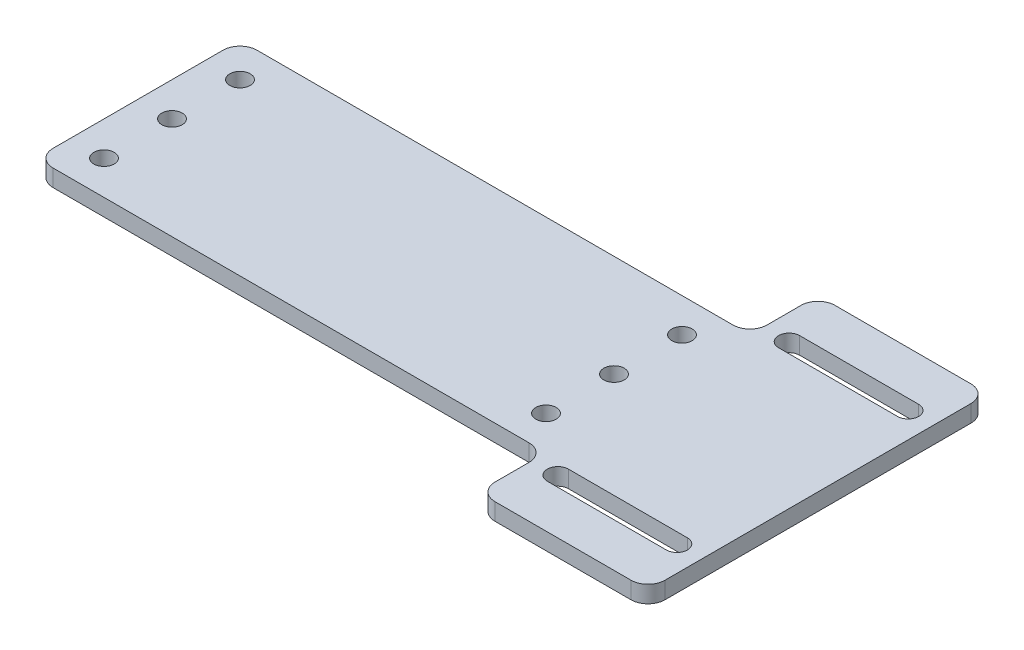
ISO-10303-21;
HEADER;
FILE_DESCRIPTION(('STEP AP214'),'2;1');
FILE_NAME('part.step','',(''),(''),'','','');
FILE_SCHEMA(('AUTOMOTIVE_DESIGN { 1 0 10303 214 1 1 1 1 }'));
ENDSEC;
DATA;
#1=APPLICATION_CONTEXT('core data for automotive mechanical design processes');
#2=APPLICATION_PROTOCOL_DEFINITION('international standard','automotive_design',2000,#1);
#3=PRODUCT_CONTEXT('',#1,'mechanical');
#4=PRODUCT('Part','Part','',(#3));
#5=PRODUCT_RELATED_PRODUCT_CATEGORY('part','',(#4));
#6=PRODUCT_DEFINITION_FORMATION('','',#4);
#7=PRODUCT_DEFINITION_CONTEXT('part definition',#1,'design');
#8=PRODUCT_DEFINITION('design','',#6,#7);
#9=PRODUCT_DEFINITION_SHAPE('','',#8);
#10=(LENGTH_UNIT() NAMED_UNIT(*) SI_UNIT(.MILLI.,.METRE.));
#11=(NAMED_UNIT(*) PLANE_ANGLE_UNIT() SI_UNIT($,.RADIAN.));
#12=(NAMED_UNIT(*) SI_UNIT($,.STERADIAN.) SOLID_ANGLE_UNIT());
#13=UNCERTAINTY_MEASURE_WITH_UNIT(LENGTH_MEASURE(1.E-05),#10,'distance_accuracy_value','');
#14=(GEOMETRIC_REPRESENTATION_CONTEXT(3) GLOBAL_UNCERTAINTY_ASSIGNED_CONTEXT((#13)) GLOBAL_UNIT_ASSIGNED_CONTEXT((#10,
#11,#12)) REPRESENTATION_CONTEXT('',''));
#15=CARTESIAN_POINT('',(0.,0.,0.));
#16=DIRECTION('',(0.,0.,1.));
#17=DIRECTION('',(1.,0.,0.));
#18=AXIS2_PLACEMENT_3D('',#15,#16,#17);
#19=CARTESIAN_POINT('',(0.,5.,0.));
#20=DIRECTION('',(0.,-1.,0.));
#21=DIRECTION('',(0.,0.,-1.));
#22=AXIS2_PLACEMENT_3D('',#19,#20,#21);
#23=PLANE('',#22);
#24=CARTESIAN_POINT('',(-90.,5.,19.9999999999999));
#25=DIRECTION('',(0.,1.,0.));
#26=DIRECTION('',(0.,0.,1.));
#27=AXIS2_PLACEMENT_3D('',#24,#25,#26);
#28=CIRCLE('',#27,3.00000000000001);
#29=CARTESIAN_POINT('',(-90.,5.,22.9999999999999));
#30=VERTEX_POINT('',#29);
#31=EDGE_CURVE('E298',#30,#30,#28,.T.);
#32=ORIENTED_EDGE('',*,*,#31,.F.);
#33=EDGE_LOOP('',(#32));
#34=FACE_BOUND('',#33,.T.);
#35=CARTESIAN_POINT('',(40.,5.,20.));
#36=DIRECTION('',(0.,1.,0.));
#37=DIRECTION('',(0.,0.,1.));
#38=AXIS2_PLACEMENT_3D('',#35,#36,#37);
#39=CIRCLE('',#38,3.);
#40=CARTESIAN_POINT('',(40.,5.,23.));
#41=VERTEX_POINT('',#40);
#42=EDGE_CURVE('E304',#41,#41,#39,.T.);
#43=ORIENTED_EDGE('',*,*,#42,.F.);
#44=EDGE_LOOP('',(#43));
#45=FACE_BOUND('',#44,.T.);
#46=CARTESIAN_POINT('',(40.,5.,-20.));
#47=DIRECTION('',(0.,1.,0.));
#48=DIRECTION('',(0.,0.,1.));
#49=AXIS2_PLACEMENT_3D('',#46,#47,#48);
#50=CIRCLE('',#49,3.);
#51=CARTESIAN_POINT('',(40.,5.,-17.));
#52=VERTEX_POINT('',#51);
#53=EDGE_CURVE('E310',#52,#52,#50,.T.);
#54=ORIENTED_EDGE('',*,*,#53,.F.);
#55=EDGE_LOOP('',(#54));
#56=FACE_BOUND('',#55,.T.);
#57=CARTESIAN_POINT('',(-90.,5.,0.));
#58=DIRECTION('',(0.,1.,0.));
#59=DIRECTION('',(0.,0.,1.));
#60=AXIS2_PLACEMENT_3D('',#57,#58,#59);
#61=CIRCLE('',#60,3.00000000000001);
#62=CARTESIAN_POINT('',(-90.,5.,3.00000000000002));
#63=VERTEX_POINT('',#62);
#64=EDGE_CURVE('E291',#63,#63,#61,.T.);
#65=ORIENTED_EDGE('',*,*,#64,.F.);
#66=EDGE_LOOP('',(#65));
#67=FACE_BOUND('',#66,.T.);
#68=CARTESIAN_POINT('',(40.,5.,0.));
#69=DIRECTION('',(0.,1.,0.));
#70=DIRECTION('',(0.,0.,1.));
#71=AXIS2_PLACEMENT_3D('',#68,#69,#70);
#72=CIRCLE('',#71,3.);
#73=CARTESIAN_POINT('',(40.,5.,3.));
#74=VERTEX_POINT('',#73);
#75=EDGE_CURVE('E277',#74,#74,#72,.T.);
#76=ORIENTED_EDGE('',*,*,#75,.F.);
#77=EDGE_LOOP('',(#76));
#78=FACE_BOUND('',#77,.T.);
#79=CARTESIAN_POINT('',(-90.,5.,-20.0000000000001));
#80=DIRECTION('',(0.,1.,0.));
#81=DIRECTION('',(0.,0.,1.));
#82=AXIS2_PLACEMENT_3D('',#79,#80,#81);
#83=CIRCLE('',#82,3.00000000000001);
#84=CARTESIAN_POINT('',(-90.,5.,-17.0000000000001));
#85=VERTEX_POINT('',#84);
#86=EDGE_CURVE('E297',#85,#85,#83,.T.);
#87=ORIENTED_EDGE('',*,*,#86,.F.);
#88=EDGE_LOOP('',(#87));
#89=FACE_BOUND('',#88,.T.);
#90=DIRECTION('',(0.,0.,-1.));
#91=VECTOR('',#90,1.);
#92=CARTESIAN_POINT('',(100.,5.,30.));
#93=LINE('',#92,#91);
#94=CARTESIAN_POINT('',(100.,5.,45.));
#95=VERTEX_POINT('',#94);
#96=CARTESIAN_POINT('',(100.,5.,-45.));
#97=VERTEX_POINT('',#96);
#98=EDGE_CURVE('E324',#95,#97,#93,.T.);
#99=ORIENTED_EDGE('',*,*,#98,.T.);
#100=CARTESIAN_POINT('',(95.,5.,-45.));
#101=DIRECTION('',(0.,-1.,0.));
#102=DIRECTION('',(0.,0.,-1.));
#103=AXIS2_PLACEMENT_3D('',#100,#101,#102);
#104=CIRCLE('',#103,5.);
#105=CARTESIAN_POINT('',(95.,5.,-50.));
#106=VERTEX_POINT('',#105);
#107=EDGE_CURVE('E378',#97,#106,#104,.F.);
#108=ORIENTED_EDGE('',*,*,#107,.T.);
#109=DIRECTION('',(1.,0.,0.));
#110=VECTOR('',#109,1.);
#111=CARTESIAN_POINT('',(50.,5.,-50.));
#112=LINE('',#111,#110);
#113=CARTESIAN_POINT('',(55.,5.,-50.));
#114=VERTEX_POINT('',#113);
#115=EDGE_CURVE('E273',#114,#106,#112,.T.);
#116=ORIENTED_EDGE('',*,*,#115,.F.);
#117=CARTESIAN_POINT('',(55.,5.,-45.));
#118=DIRECTION('',(0.,-1.,0.));
#119=DIRECTION('',(0.,0.,-1.));
#120=AXIS2_PLACEMENT_3D('',#117,#118,#119);
#121=CIRCLE('',#120,5.);
#122=CARTESIAN_POINT('',(50.,5.,-45.));
#123=VERTEX_POINT('',#122);
#124=EDGE_CURVE('E376',#114,#123,#121,.F.);
#125=ORIENTED_EDGE('',*,*,#124,.T.);
#126=DIRECTION('',(0.,0.,-1.));
#127=VECTOR('',#126,1.);
#128=CARTESIAN_POINT('',(50.,5.,50.));
#129=LINE('',#128,#127);
#130=CARTESIAN_POINT('',(50.,5.,-35.));
#131=VERTEX_POINT('',#130);
#132=EDGE_CURVE('E272',#131,#123,#129,.T.);
#133=ORIENTED_EDGE('',*,*,#132,.F.);
#134=CARTESIAN_POINT('',(45.,5.,-35.));
#135=DIRECTION('',(0.,-1.,0.));
#136=DIRECTION('',(0.,0.,-1.));
#137=AXIS2_PLACEMENT_3D('',#134,#135,#136);
#138=CIRCLE('',#137,5.);
#139=CARTESIAN_POINT('',(45.,5.,-30.));
#140=VERTEX_POINT('',#139);
#141=EDGE_CURVE('E409',#131,#140,#138,.T.);
#142=ORIENTED_EDGE('',*,*,#141,.T.);
#143=DIRECTION('',(-1.,0.,0.));
#144=VECTOR('',#143,1.);
#145=CARTESIAN_POINT('',(-100.,5.,-30.));
#146=LINE('',#145,#144);
#147=CARTESIAN_POINT('',(-95.,5.,-30.));
#148=VERTEX_POINT('',#147);
#149=EDGE_CURVE('E327',#140,#148,#146,.T.);
#150=ORIENTED_EDGE('',*,*,#149,.T.);
#151=CARTESIAN_POINT('',(-95.,5.,-25.));
#152=DIRECTION('',(0.,-1.,0.));
#153=DIRECTION('',(0.,0.,-1.));
#154=AXIS2_PLACEMENT_3D('',#151,#152,#153);
#155=CIRCLE('',#154,5.);
#156=CARTESIAN_POINT('',(-100.,5.,-25.));
#157=VERTEX_POINT('',#156);
#158=EDGE_CURVE('E369',#148,#157,#155,.F.);
#159=ORIENTED_EDGE('',*,*,#158,.T.);
#160=DIRECTION('',(0.,0.,1.));
#161=VECTOR('',#160,1.);
#162=CARTESIAN_POINT('',(-100.,5.,30.));
#163=LINE('',#162,#161);
#164=CARTESIAN_POINT('',(-100.,5.,25.));
#165=VERTEX_POINT('',#164);
#166=EDGE_CURVE('E331',#157,#165,#163,.T.);
#167=ORIENTED_EDGE('',*,*,#166,.T.);
#168=CARTESIAN_POINT('',(-95.,5.,25.));
#169=DIRECTION('',(0.,-1.,0.));
#170=DIRECTION('',(0.,0.,-1.));
#171=AXIS2_PLACEMENT_3D('',#168,#169,#170);
#172=CIRCLE('',#171,5.);
#173=CARTESIAN_POINT('',(-95.,5.,30.));
#174=VERTEX_POINT('',#173);
#175=EDGE_CURVE('E371',#165,#174,#172,.F.);
#176=ORIENTED_EDGE('',*,*,#175,.T.);
#177=DIRECTION('',(1.,0.,0.));
#178=VECTOR('',#177,1.);
#179=CARTESIAN_POINT('',(-100.,5.,30.));
#180=LINE('',#179,#178);
#181=CARTESIAN_POINT('',(45.,5.,30.));
#182=VERTEX_POINT('',#181);
#183=EDGE_CURVE('E334',#174,#182,#180,.T.);
#184=ORIENTED_EDGE('',*,*,#183,.T.);
#185=CARTESIAN_POINT('',(45.,5.,35.));
#186=DIRECTION('',(0.,-1.,0.));
#187=DIRECTION('',(0.,0.,-1.));
#188=AXIS2_PLACEMENT_3D('',#185,#186,#187);
#189=CIRCLE('',#188,5.);
#190=CARTESIAN_POINT('',(50.,5.,35.));
#191=VERTEX_POINT('',#190);
#192=EDGE_CURVE('E11',#182,#191,#189,.T.);
#193=ORIENTED_EDGE('',*,*,#192,.T.);
#194=CARTESIAN_POINT('',(50.,5.,45.));
#195=VERTEX_POINT('',#194);
#196=EDGE_CURVE('E274',#195,#191,#129,.T.);
#197=ORIENTED_EDGE('',*,*,#196,.F.);
#198=CARTESIAN_POINT('',(55.,5.,45.));
#199=DIRECTION('',(0.,-1.,0.));
#200=DIRECTION('',(0.,0.,-1.));
#201=AXIS2_PLACEMENT_3D('',#198,#199,#200);
#202=CIRCLE('',#201,5.);
#203=CARTESIAN_POINT('',(55.,5.,50.));
#204=VERTEX_POINT('',#203);
#205=EDGE_CURVE('E48',#195,#204,#202,.F.);
#206=ORIENTED_EDGE('',*,*,#205,.T.);
#207=DIRECTION('',(-1.,0.,0.));
#208=VECTOR('',#207,1.);
#209=CARTESIAN_POINT('',(50.,5.,50.));
#210=LINE('',#209,#208);
#211=CARTESIAN_POINT('',(95.,5.,50.));
#212=VERTEX_POINT('',#211);
#213=EDGE_CURVE('E270',#212,#204,#210,.T.);
#214=ORIENTED_EDGE('',*,*,#213,.F.);
#215=CARTESIAN_POINT('',(95.,5.,45.));
#216=DIRECTION('',(0.,-1.,0.));
#217=DIRECTION('',(0.,0.,-1.));
#218=AXIS2_PLACEMENT_3D('',#215,#216,#217);
#219=CIRCLE('',#218,5.);
#220=EDGE_CURVE('E374',#212,#95,#219,.F.);
#221=ORIENTED_EDGE('',*,*,#220,.T.);
#222=EDGE_LOOP('',(#99,#108,#116,#125,#133,#142,#150,#159,#167,#176,#184,#193,#197,#206,#214,#221));
#223=FACE_BOUND('',#222,.T.);
#224=DIRECTION('',(1.,0.,0.));
#225=VECTOR('',#224,1.);
#226=CARTESIAN_POINT('',(57.5,5.,37.105));
#227=LINE('',#226,#225);
#228=CARTESIAN_POINT('',(57.5,5.,37.105));
#229=VERTEX_POINT('',#228);
#230=CARTESIAN_POINT('',(92.5,5.,37.105));
#231=VERTEX_POINT('',#230);
#232=EDGE_CURVE('E253',#229,#231,#227,.T.);
#233=ORIENTED_EDGE('',*,*,#232,.F.);
#234=CARTESIAN_POINT('',(57.5,5.,34.005));
#235=DIRECTION('',(0.,1.,0.));
#236=DIRECTION('',(0.,0.,1.));
#237=AXIS2_PLACEMENT_3D('',#234,#235,#236);
#238=CIRCLE('',#237,3.1);
#239=CARTESIAN_POINT('',(57.5,5.,30.905));
#240=VERTEX_POINT('',#239);
#241=EDGE_CURVE('E234',#240,#229,#238,.T.);
#242=ORIENTED_EDGE('',*,*,#241,.F.);
#243=DIRECTION('',(-1.,0.,0.));
#244=VECTOR('',#243,1.);
#245=CARTESIAN_POINT('',(57.5,5.,30.905));
#246=LINE('',#245,#244);
#247=CARTESIAN_POINT('',(92.5,5.,30.905));
#248=VERTEX_POINT('',#247);
#249=EDGE_CURVE('E242',#248,#240,#246,.T.);
#250=ORIENTED_EDGE('',*,*,#249,.F.);
#251=CARTESIAN_POINT('',(92.5,5.,34.005));
#252=DIRECTION('',(0.,1.,0.));
#253=DIRECTION('',(0.,0.,1.));
#254=AXIS2_PLACEMENT_3D('',#251,#252,#253);
#255=CIRCLE('',#254,3.1);
#256=EDGE_CURVE('E256',#231,#248,#255,.T.);
#257=ORIENTED_EDGE('',*,*,#256,.F.);
#258=EDGE_LOOP('',(#233,#242,#250,#257));
#259=FACE_BOUND('',#258,.T.);
#260=CARTESIAN_POINT('',(57.5,5.,-34.005));
#261=DIRECTION('',(0.,-1.,0.));
#262=DIRECTION('',(0.,0.,-1.));
#263=AXIS2_PLACEMENT_3D('',#260,#261,#262);
#264=CIRCLE('',#263,3.1);
#265=CARTESIAN_POINT('',(57.5,5.,-30.905));
#266=VERTEX_POINT('',#265);
#267=CARTESIAN_POINT('',(57.5,5.,-37.105));
#268=VERTEX_POINT('',#267);
#269=EDGE_CURVE('E214',#266,#268,#264,.T.);
#270=ORIENTED_EDGE('',*,*,#269,.T.);
#271=DIRECTION('',(1.,0.,0.));
#272=VECTOR('',#271,1.);
#273=CARTESIAN_POINT('',(57.5,5.,-37.105));
#274=LINE('',#273,#272);
#275=CARTESIAN_POINT('',(92.5,5.,-37.105));
#276=VERTEX_POINT('',#275);
#277=EDGE_CURVE('E219',#268,#276,#274,.T.);
#278=ORIENTED_EDGE('',*,*,#277,.T.);
#279=CARTESIAN_POINT('',(92.5,5.,-34.005));
#280=DIRECTION('',(0.,-1.,0.));
#281=DIRECTION('',(0.,0.,-1.));
#282=AXIS2_PLACEMENT_3D('',#279,#280,#281);
#283=CIRCLE('',#282,3.1);
#284=CARTESIAN_POINT('',(92.5,5.,-30.905));
#285=VERTEX_POINT('',#284);
#286=EDGE_CURVE('E222',#276,#285,#283,.T.);
#287=ORIENTED_EDGE('',*,*,#286,.T.);
#288=DIRECTION('',(-1.,0.,0.));
#289=VECTOR('',#288,1.);
#290=CARTESIAN_POINT('',(57.5,5.,-30.905));
#291=LINE('',#290,#289);
#292=EDGE_CURVE('E228',#285,#266,#291,.T.);
#293=ORIENTED_EDGE('',*,*,#292,.T.);
#294=EDGE_LOOP('',(#270,#278,#287,#293));
#295=FACE_BOUND('',#294,.T.);
#296=ADVANCED_FACE('F33',(#34,#45,#56,#67,#78,#89,#223,#259,#295),#23,.F.);
#297=CARTESIAN_POINT('',(0.,0.,0.));
#298=DIRECTION('',(0.,-1.,0.));
#299=DIRECTION('',(0.,0.,-1.));
#300=AXIS2_PLACEMENT_3D('',#297,#298,#299);
#301=PLANE('',#300);
#302=CARTESIAN_POINT('',(57.5,0.,34.005));
#303=DIRECTION('',(0.,1.,0.));
#304=DIRECTION('',(0.,0.,1.));
#305=AXIS2_PLACEMENT_3D('',#302,#303,#304);
#306=CIRCLE('',#305,3.1);
#307=CARTESIAN_POINT('',(57.5,0.,30.905));
#308=VERTEX_POINT('',#307);
#309=CARTESIAN_POINT('',(57.5,0.,37.105));
#310=VERTEX_POINT('',#309);
#311=EDGE_CURVE('E238',#308,#310,#306,.T.);
#312=ORIENTED_EDGE('',*,*,#311,.T.);
#313=DIRECTION('',(1.,0.,0.));
#314=VECTOR('',#313,1.);
#315=CARTESIAN_POINT('',(57.5,0.,37.105));
#316=LINE('',#315,#314);
#317=CARTESIAN_POINT('',(92.5,0.,37.105));
#318=VERTEX_POINT('',#317);
#319=EDGE_CURVE('E241',#310,#318,#316,.T.);
#320=ORIENTED_EDGE('',*,*,#319,.T.);
#321=CARTESIAN_POINT('',(92.5,0.,34.005));
#322=DIRECTION('',(0.,1.,0.));
#323=DIRECTION('',(0.,0.,1.));
#324=AXIS2_PLACEMENT_3D('',#321,#322,#323);
#325=CIRCLE('',#324,3.1);
#326=CARTESIAN_POINT('',(92.5,0.,30.905));
#327=VERTEX_POINT('',#326);
#328=EDGE_CURVE('E245',#318,#327,#325,.T.);
#329=ORIENTED_EDGE('',*,*,#328,.T.);
#330=DIRECTION('',(-1.,0.,0.));
#331=VECTOR('',#330,1.);
#332=CARTESIAN_POINT('',(57.5,0.,30.905));
#333=LINE('',#332,#331);
#334=EDGE_CURVE('E248',#327,#308,#333,.T.);
#335=ORIENTED_EDGE('',*,*,#334,.T.);
#336=EDGE_LOOP('',(#312,#320,#329,#335));
#337=FACE_BOUND('',#336,.T.);
#338=DIRECTION('',(-1.,0.,0.));
#339=VECTOR('',#338,1.);
#340=CARTESIAN_POINT('',(50.,0.,-50.));
#341=LINE('',#340,#339);
#342=CARTESIAN_POINT('',(95.,0.,-50.));
#343=VERTEX_POINT('',#342);
#344=CARTESIAN_POINT('',(55.,0.,-50.));
#345=VERTEX_POINT('',#344);
#346=EDGE_CURVE('E283',#343,#345,#341,.T.);
#347=ORIENTED_EDGE('',*,*,#346,.F.);
#348=CARTESIAN_POINT('',(95.,0.,-45.));
#349=DIRECTION('',(0.,-1.,0.));
#350=DIRECTION('',(0.,0.,-1.));
#351=AXIS2_PLACEMENT_3D('',#348,#349,#350);
#352=CIRCLE('',#351,5.);
#353=CARTESIAN_POINT('',(100.,0.,-45.));
#354=VERTEX_POINT('',#353);
#355=EDGE_CURVE('E362',#343,#354,#352,.T.);
#356=ORIENTED_EDGE('',*,*,#355,.T.);
#357=DIRECTION('',(0.,0.,-1.));
#358=VECTOR('',#357,1.);
#359=CARTESIAN_POINT('',(100.,0.,30.));
#360=LINE('',#359,#358);
#361=CARTESIAN_POINT('',(100.,0.,45.));
#362=VERTEX_POINT('',#361);
#363=EDGE_CURVE('E321',#362,#354,#360,.T.);
#364=ORIENTED_EDGE('',*,*,#363,.F.);
#365=CARTESIAN_POINT('',(95.,0.,45.));
#366=DIRECTION('',(0.,-1.,0.));
#367=DIRECTION('',(0.,0.,-1.));
#368=AXIS2_PLACEMENT_3D('',#365,#366,#367);
#369=CIRCLE('',#368,5.);
#370=CARTESIAN_POINT('',(95.,0.,50.));
#371=VERTEX_POINT('',#370);
#372=EDGE_CURVE('E358',#362,#371,#369,.T.);
#373=ORIENTED_EDGE('',*,*,#372,.T.);
#374=DIRECTION('',(1.,0.,0.));
#375=VECTOR('',#374,1.);
#376=CARTESIAN_POINT('',(50.,0.,50.));
#377=LINE('',#376,#375);
#378=CARTESIAN_POINT('',(55.,0.,50.));
#379=VERTEX_POINT('',#378);
#380=EDGE_CURVE('E281',#379,#371,#377,.T.);
#381=ORIENTED_EDGE('',*,*,#380,.F.);
#382=CARTESIAN_POINT('',(55.,0.,45.));
#383=DIRECTION('',(0.,-1.,0.));
#384=DIRECTION('',(0.,0.,-1.));
#385=AXIS2_PLACEMENT_3D('',#382,#383,#384);
#386=CIRCLE('',#385,5.);
#387=CARTESIAN_POINT('',(50.,0.,45.));
#388=VERTEX_POINT('',#387);
#389=EDGE_CURVE('E356',#379,#388,#386,.T.);
#390=ORIENTED_EDGE('',*,*,#389,.T.);
#391=DIRECTION('',(0.,0.,1.));
#392=VECTOR('',#391,1.);
#393=CARTESIAN_POINT('',(50.,0.,50.));
#394=LINE('',#393,#392);
#395=CARTESIAN_POINT('',(50.,0.,35.));
#396=VERTEX_POINT('',#395);
#397=EDGE_CURVE('E263',#396,#388,#394,.T.);
#398=ORIENTED_EDGE('',*,*,#397,.F.);
#399=CARTESIAN_POINT('',(45.,0.,35.));
#400=DIRECTION('',(0.,-1.,0.));
#401=DIRECTION('',(0.,0.,-1.));
#402=AXIS2_PLACEMENT_3D('',#399,#400,#401);
#403=CIRCLE('',#402,5.);
#404=CARTESIAN_POINT('',(45.,0.,30.));
#405=VERTEX_POINT('',#404);
#406=EDGE_CURVE('E41',#396,#405,#403,.F.);
#407=ORIENTED_EDGE('',*,*,#406,.T.);
#408=DIRECTION('',(1.,0.,0.));
#409=VECTOR('',#408,1.);
#410=CARTESIAN_POINT('',(-100.,0.,30.));
#411=LINE('',#410,#409);
#412=CARTESIAN_POINT('',(-95.,0.,30.));
#413=VERTEX_POINT('',#412);
#414=EDGE_CURVE('E328',#413,#405,#411,.T.);
#415=ORIENTED_EDGE('',*,*,#414,.F.);
#416=CARTESIAN_POINT('',(-95.,0.,25.));
#417=DIRECTION('',(0.,-1.,0.));
#418=DIRECTION('',(0.,0.,-1.));
#419=AXIS2_PLACEMENT_3D('',#416,#417,#418);
#420=CIRCLE('',#419,5.);
#421=CARTESIAN_POINT('',(-100.,0.,25.));
#422=VERTEX_POINT('',#421);
#423=EDGE_CURVE('E354',#413,#422,#420,.T.);
#424=ORIENTED_EDGE('',*,*,#423,.T.);
#425=DIRECTION('',(0.,0.,1.));
#426=VECTOR('',#425,1.);
#427=CARTESIAN_POINT('',(-100.,0.,30.));
#428=LINE('',#427,#426);
#429=CARTESIAN_POINT('',(-100.,0.,-25.));
#430=VERTEX_POINT('',#429);
#431=EDGE_CURVE('E343',#430,#422,#428,.T.);
#432=ORIENTED_EDGE('',*,*,#431,.F.);
#433=CARTESIAN_POINT('',(-95.,0.,-25.));
#434=DIRECTION('',(0.,-1.,0.));
#435=DIRECTION('',(0.,0.,-1.));
#436=AXIS2_PLACEMENT_3D('',#433,#434,#435);
#437=CIRCLE('',#436,5.);
#438=CARTESIAN_POINT('',(-95.,0.,-30.));
#439=VERTEX_POINT('',#438);
#440=EDGE_CURVE('E352',#430,#439,#437,.T.);
#441=ORIENTED_EDGE('',*,*,#440,.T.);
#442=DIRECTION('',(-1.,0.,0.));
#443=VECTOR('',#442,1.);
#444=CARTESIAN_POINT('',(-100.,0.,-30.));
#445=LINE('',#444,#443);
#446=CARTESIAN_POINT('',(45.,0.,-30.));
#447=VERTEX_POINT('',#446);
#448=EDGE_CURVE('E340',#447,#439,#445,.T.);
#449=ORIENTED_EDGE('',*,*,#448,.F.);
#450=CARTESIAN_POINT('',(45.,0.,-35.));
#451=DIRECTION('',(0.,-1.,0.));
#452=DIRECTION('',(0.,0.,-1.));
#453=AXIS2_PLACEMENT_3D('',#450,#451,#452);
#454=CIRCLE('',#453,5.);
#455=CARTESIAN_POINT('',(50.,0.,-35.));
#456=VERTEX_POINT('',#455);
#457=EDGE_CURVE('E411',#447,#456,#454,.F.);
#458=ORIENTED_EDGE('',*,*,#457,.T.);
#459=CARTESIAN_POINT('',(50.,0.,-45.));
#460=VERTEX_POINT('',#459);
#461=EDGE_CURVE('E278',#460,#456,#394,.T.);
#462=ORIENTED_EDGE('',*,*,#461,.F.);
#463=CARTESIAN_POINT('',(55.,0.,-45.));
#464=DIRECTION('',(0.,-1.,0.));
#465=DIRECTION('',(0.,0.,-1.));
#466=AXIS2_PLACEMENT_3D('',#463,#464,#465);
#467=CIRCLE('',#466,5.);
#468=EDGE_CURVE('E360',#460,#345,#467,.T.);
#469=ORIENTED_EDGE('',*,*,#468,.T.);
#470=EDGE_LOOP('',(#347,#356,#364,#373,#381,#390,#398,#407,#415,#424,#432,#441,#449,#458,#462,#469));
#471=FACE_BOUND('',#470,.T.);
#472=CARTESIAN_POINT('',(-90.,0.,19.9999999999999));
#473=DIRECTION('',(0.,1.,0.));
#474=DIRECTION('',(0.,0.,1.));
#475=AXIS2_PLACEMENT_3D('',#472,#473,#474);
#476=CIRCLE('',#475,3.00000000000001);
#477=CARTESIAN_POINT('',(-90.,0.,22.9999999999999));
#478=VERTEX_POINT('',#477);
#479=EDGE_CURVE('E294',#478,#478,#476,.T.);
#480=ORIENTED_EDGE('',*,*,#479,.T.);
#481=EDGE_LOOP('',(#480));
#482=FACE_BOUND('',#481,.T.);
#483=CARTESIAN_POINT('',(40.,0.,20.));
#484=DIRECTION('',(0.,1.,0.));
#485=DIRECTION('',(0.,0.,1.));
#486=AXIS2_PLACEMENT_3D('',#483,#484,#485);
#487=CIRCLE('',#486,3.);
#488=CARTESIAN_POINT('',(40.,0.,23.));
#489=VERTEX_POINT('',#488);
#490=EDGE_CURVE('E301',#489,#489,#487,.T.);
#491=ORIENTED_EDGE('',*,*,#490,.T.);
#492=EDGE_LOOP('',(#491));
#493=FACE_BOUND('',#492,.T.);
#494=CARTESIAN_POINT('',(40.,0.,-20.));
#495=DIRECTION('',(0.,1.,0.));
#496=DIRECTION('',(0.,0.,1.));
#497=AXIS2_PLACEMENT_3D('',#494,#495,#496);
#498=CIRCLE('',#497,3.);
#499=CARTESIAN_POINT('',(40.,0.,-17.));
#500=VERTEX_POINT('',#499);
#501=EDGE_CURVE('E307',#500,#500,#498,.T.);
#502=ORIENTED_EDGE('',*,*,#501,.T.);
#503=EDGE_LOOP('',(#502));
#504=FACE_BOUND('',#503,.T.);
#505=CARTESIAN_POINT('',(-90.,0.,0.));
#506=DIRECTION('',(0.,1.,0.));
#507=DIRECTION('',(0.,0.,1.));
#508=AXIS2_PLACEMENT_3D('',#505,#506,#507);
#509=CIRCLE('',#508,3.00000000000001);
#510=CARTESIAN_POINT('',(-90.,0.,3.00000000000002));
#511=VERTEX_POINT('',#510);
#512=EDGE_CURVE('E313',#511,#511,#509,.T.);
#513=ORIENTED_EDGE('',*,*,#512,.T.);
#514=EDGE_LOOP('',(#513));
#515=FACE_BOUND('',#514,.T.);
#516=CARTESIAN_POINT('',(40.,0.,0.));
#517=DIRECTION('',(0.,1.,0.));
#518=DIRECTION('',(0.,0.,1.));
#519=AXIS2_PLACEMENT_3D('',#516,#517,#518);
#520=CIRCLE('',#519,3.);
#521=CARTESIAN_POINT('',(40.,0.,3.));
#522=VERTEX_POINT('',#521);
#523=EDGE_CURVE('E288',#522,#522,#520,.T.);
#524=ORIENTED_EDGE('',*,*,#523,.T.);
#525=EDGE_LOOP('',(#524));
#526=FACE_BOUND('',#525,.T.);
#527=CARTESIAN_POINT('',(-90.,0.,-20.0000000000001));
#528=DIRECTION('',(0.,1.,0.));
#529=DIRECTION('',(0.,0.,1.));
#530=AXIS2_PLACEMENT_3D('',#527,#528,#529);
#531=CIRCLE('',#530,3.00000000000001);
#532=CARTESIAN_POINT('',(-90.,0.,-17.0000000000001));
#533=VERTEX_POINT('',#532);
#534=EDGE_CURVE('E318',#533,#533,#531,.T.);
#535=ORIENTED_EDGE('',*,*,#534,.T.);
#536=EDGE_LOOP('',(#535));
#537=FACE_BOUND('',#536,.T.);
#538=DIRECTION('',(1.,0.,0.));
#539=VECTOR('',#538,1.);
#540=CARTESIAN_POINT('',(57.5,0.,-37.105));
#541=LINE('',#540,#539);
#542=CARTESIAN_POINT('',(57.5,0.,-37.105));
#543=VERTEX_POINT('',#542);
#544=CARTESIAN_POINT('',(92.5,0.,-37.105));
#545=VERTEX_POINT('',#544);
#546=EDGE_CURVE('E215',#543,#545,#541,.T.);
#547=ORIENTED_EDGE('',*,*,#546,.F.);
#548=CARTESIAN_POINT('',(57.5,0.,-34.005));
#549=DIRECTION('',(0.,-1.,0.));
#550=DIRECTION('',(0.,0.,-1.));
#551=AXIS2_PLACEMENT_3D('',#548,#549,#550);
#552=CIRCLE('',#551,3.1);
#553=CARTESIAN_POINT('',(57.5,0.,-30.905));
#554=VERTEX_POINT('',#553);
#555=EDGE_CURVE('E207',#554,#543,#552,.T.);
#556=ORIENTED_EDGE('',*,*,#555,.F.);
#557=DIRECTION('',(-1.,0.,0.));
#558=VECTOR('',#557,1.);
#559=CARTESIAN_POINT('',(57.5,0.,-30.905));
#560=LINE('',#559,#558);
#561=CARTESIAN_POINT('',(92.5,0.,-30.905));
#562=VERTEX_POINT('',#561);
#563=EDGE_CURVE('E195',#562,#554,#560,.T.);
#564=ORIENTED_EDGE('',*,*,#563,.F.);
#565=CARTESIAN_POINT('',(92.5,0.,-34.005));
#566=DIRECTION('',(0.,-1.,0.));
#567=DIRECTION('',(0.,0.,-1.));
#568=AXIS2_PLACEMENT_3D('',#565,#566,#567);
#569=CIRCLE('',#568,3.1);
#570=EDGE_CURVE('E206',#545,#562,#569,.T.);
#571=ORIENTED_EDGE('',*,*,#570,.F.);
#572=EDGE_LOOP('',(#547,#556,#564,#571));
#573=FACE_BOUND('',#572,.T.);
#574=ADVANCED_FACE('F218',(#337,#471,#482,#493,#504,#515,#526,#537,#573),#301,.T.);
#575=CARTESIAN_POINT('',(-100.,5.,-30.));
#576=DIRECTION('',(0.,0.,1.));
#577=DIRECTION('',(1.,0.,0.));
#578=AXIS2_PLACEMENT_3D('',#575,#576,#577);
#579=PLANE('',#578);
#580=ORIENTED_EDGE('',*,*,#149,.F.);
#581=DIRECTION('',(0.,1.,0.));
#582=VECTOR('',#581,1.);
#583=CARTESIAN_POINT('',(45.,0.,-30.));
#584=LINE('',#583,#582);
#585=EDGE_CURVE('E388',#140,#447,#584,.F.);
#586=ORIENTED_EDGE('',*,*,#585,.T.);
#587=ORIENTED_EDGE('',*,*,#448,.T.);
#588=DIRECTION('',(0.,-1.,0.));
#589=VECTOR('',#588,1.);
#590=CARTESIAN_POINT('',(-95.,5.,-30.));
#591=LINE('',#590,#589);
#592=EDGE_CURVE('E386',#439,#148,#591,.F.);
#593=ORIENTED_EDGE('',*,*,#592,.T.);
#594=EDGE_LOOP('',(#580,#586,#587,#593));
#595=FACE_BOUND('',#594,.T.);
#596=ADVANCED_FACE('F468',(#595),#579,.F.);
#597=CARTESIAN_POINT('',(-100.,5.,30.));
#598=DIRECTION('',(0.,0.,-1.));
#599=DIRECTION('',(-1.,0.,0.));
#600=AXIS2_PLACEMENT_3D('',#597,#598,#599);
#601=PLANE('',#600);
#602=ORIENTED_EDGE('',*,*,#414,.T.);
#603=DIRECTION('',(0.,-1.,0.));
#604=VECTOR('',#603,1.);
#605=CARTESIAN_POINT('',(45.,5.,30.));
#606=LINE('',#605,#604);
#607=EDGE_CURVE('E402',#405,#182,#606,.F.);
#608=ORIENTED_EDGE('',*,*,#607,.T.);
#609=ORIENTED_EDGE('',*,*,#183,.F.);
#610=DIRECTION('',(0.,-1.,0.));
#611=VECTOR('',#610,1.);
#612=CARTESIAN_POINT('',(-95.,5.,30.));
#613=LINE('',#612,#611);
#614=EDGE_CURVE('E399',#174,#413,#613,.T.);
#615=ORIENTED_EDGE('',*,*,#614,.T.);
#616=EDGE_LOOP('',(#602,#608,#609,#615));
#617=FACE_BOUND('',#616,.T.);
#618=ADVANCED_FACE('F422',(#617),#601,.F.);
#619=CARTESIAN_POINT('',(100.,5.,30.));
#620=DIRECTION('',(-1.,0.,0.));
#621=DIRECTION('',(0.,0.,1.));
#622=AXIS2_PLACEMENT_3D('',#619,#620,#621);
#623=PLANE('',#622);
#624=ORIENTED_EDGE('',*,*,#363,.T.);
#625=DIRECTION('',(0.,-1.,0.));
#626=VECTOR('',#625,1.);
#627=CARTESIAN_POINT('',(100.,5.,-45.));
#628=LINE('',#627,#626);
#629=EDGE_CURVE('E367',#354,#97,#628,.F.);
#630=ORIENTED_EDGE('',*,*,#629,.T.);
#631=ORIENTED_EDGE('',*,*,#98,.F.);
#632=DIRECTION('',(0.,-1.,0.));
#633=VECTOR('',#632,1.);
#634=CARTESIAN_POINT('',(100.,5.,45.));
#635=LINE('',#634,#633);
#636=EDGE_CURVE('E364',#95,#362,#635,.T.);
#637=ORIENTED_EDGE('',*,*,#636,.T.);
#638=EDGE_LOOP('',(#624,#630,#631,#637));
#639=FACE_BOUND('',#638,.T.);
#640=ADVANCED_FACE('F443',(#639),#623,.F.);
#641=CARTESIAN_POINT('',(-100.,5.,30.));
#642=DIRECTION('',(1.,0.,0.));
#643=DIRECTION('',(0.,0.,-1.));
#644=AXIS2_PLACEMENT_3D('',#641,#642,#643);
#645=PLANE('',#644);
#646=ORIENTED_EDGE('',*,*,#431,.T.);
#647=DIRECTION('',(0.,-1.,0.));
#648=VECTOR('',#647,1.);
#649=CARTESIAN_POINT('',(-100.,5.,25.));
#650=LINE('',#649,#648);
#651=EDGE_CURVE('E407',#422,#165,#650,.F.);
#652=ORIENTED_EDGE('',*,*,#651,.T.);
#653=ORIENTED_EDGE('',*,*,#166,.F.);
#654=DIRECTION('',(0.,-1.,0.));
#655=VECTOR('',#654,1.);
#656=CARTESIAN_POINT('',(-100.,5.,-25.));
#657=LINE('',#656,#655);
#658=EDGE_CURVE('E404',#157,#430,#657,.T.);
#659=ORIENTED_EDGE('',*,*,#658,.T.);
#660=EDGE_LOOP('',(#646,#652,#653,#659));
#661=FACE_BOUND('',#660,.T.);
#662=ADVANCED_FACE('F479',(#661),#645,.F.);
#663=CARTESIAN_POINT('',(-90.,0.,-20.0000000000001));
#664=DIRECTION('',(0.,1.,0.));
#665=DIRECTION('',(0.,0.,1.));
#666=AXIS2_PLACEMENT_3D('',#663,#664,#665);
#667=CYLINDRICAL_SURFACE('',#666,3.00000000000001);
#668=ORIENTED_EDGE('',*,*,#534,.F.);
#669=EDGE_LOOP('',(#668));
#670=FACE_BOUND('',#669,.T.);
#671=ORIENTED_EDGE('',*,*,#86,.T.);
#672=EDGE_LOOP('',(#671));
#673=FACE_BOUND('',#672,.T.);
#674=ADVANCED_FACE('F500',(#670,#673),#667,.F.);
#675=CARTESIAN_POINT('',(40.,0.,0.));
#676=DIRECTION('',(0.,1.,0.));
#677=DIRECTION('',(0.,0.,1.));
#678=AXIS2_PLACEMENT_3D('',#675,#676,#677);
#679=CYLINDRICAL_SURFACE('',#678,3.);
#680=ORIENTED_EDGE('',*,*,#523,.F.);
#681=EDGE_LOOP('',(#680));
#682=FACE_BOUND('',#681,.T.);
#683=ORIENTED_EDGE('',*,*,#75,.T.);
#684=EDGE_LOOP('',(#683));
#685=FACE_BOUND('',#684,.T.);
#686=ADVANCED_FACE('F721',(#682,#685),#679,.F.);
#687=CARTESIAN_POINT('',(-90.,0.,0.));
#688=DIRECTION('',(0.,1.,0.));
#689=DIRECTION('',(0.,0.,1.));
#690=AXIS2_PLACEMENT_3D('',#687,#688,#689);
#691=CYLINDRICAL_SURFACE('',#690,3.00000000000001);
#692=ORIENTED_EDGE('',*,*,#512,.F.);
#693=EDGE_LOOP('',(#692));
#694=FACE_BOUND('',#693,.T.);
#695=ORIENTED_EDGE('',*,*,#64,.T.);
#696=EDGE_LOOP('',(#695));
#697=FACE_BOUND('',#696,.T.);
#698=ADVANCED_FACE('F724',(#694,#697),#691,.F.);
#699=CARTESIAN_POINT('',(40.,0.,-20.));
#700=DIRECTION('',(0.,1.,0.));
#701=DIRECTION('',(0.,0.,1.));
#702=AXIS2_PLACEMENT_3D('',#699,#700,#701);
#703=CYLINDRICAL_SURFACE('',#702,3.);
#704=ORIENTED_EDGE('',*,*,#501,.F.);
#705=EDGE_LOOP('',(#704));
#706=FACE_BOUND('',#705,.T.);
#707=ORIENTED_EDGE('',*,*,#53,.T.);
#708=EDGE_LOOP('',(#707));
#709=FACE_BOUND('',#708,.T.);
#710=ADVANCED_FACE('F731',(#706,#709),#703,.F.);
#711=CARTESIAN_POINT('',(40.,0.,20.));
#712=DIRECTION('',(0.,1.,0.));
#713=DIRECTION('',(0.,0.,1.));
#714=AXIS2_PLACEMENT_3D('',#711,#712,#713);
#715=CYLINDRICAL_SURFACE('',#714,3.);
#716=ORIENTED_EDGE('',*,*,#490,.F.);
#717=EDGE_LOOP('',(#716));
#718=FACE_BOUND('',#717,.T.);
#719=ORIENTED_EDGE('',*,*,#42,.T.);
#720=EDGE_LOOP('',(#719));
#721=FACE_BOUND('',#720,.T.);
#722=ADVANCED_FACE('F727',(#718,#721),#715,.F.);
#723=CARTESIAN_POINT('',(-90.,0.,19.9999999999999));
#724=DIRECTION('',(0.,1.,0.));
#725=DIRECTION('',(0.,0.,1.));
#726=AXIS2_PLACEMENT_3D('',#723,#724,#725);
#727=CYLINDRICAL_SURFACE('',#726,3.00000000000001);
#728=ORIENTED_EDGE('',*,*,#479,.F.);
#729=EDGE_LOOP('',(#728));
#730=FACE_BOUND('',#729,.T.);
#731=ORIENTED_EDGE('',*,*,#31,.T.);
#732=EDGE_LOOP('',(#731));
#733=FACE_BOUND('',#732,.T.);
#734=ADVANCED_FACE('F645',(#730,#733),#727,.F.);
#735=CARTESIAN_POINT('',(50.,116.803398874989,50.));
#736=DIRECTION('',(0.,0.,-1.));
#737=DIRECTION('',(-1.,0.,0.));
#738=AXIS2_PLACEMENT_3D('',#735,#736,#737);
#739=PLANE('',#738);
#740=ORIENTED_EDGE('',*,*,#380,.T.);
#741=DIRECTION('',(0.,-1.,0.));
#742=VECTOR('',#741,1.);
#743=CARTESIAN_POINT('',(95.,116.803398874989,50.));
#744=LINE('',#743,#742);
#745=EDGE_CURVE('E55',#371,#212,#744,.F.);
#746=ORIENTED_EDGE('',*,*,#745,.T.);
#747=ORIENTED_EDGE('',*,*,#213,.T.);
#748=DIRECTION('',(0.,-1.,0.));
#749=VECTOR('',#748,1.);
#750=CARTESIAN_POINT('',(55.,116.803398874989,50.));
#751=LINE('',#750,#749);
#752=EDGE_CURVE('E390',#204,#379,#751,.T.);
#753=ORIENTED_EDGE('',*,*,#752,.T.);
#754=EDGE_LOOP('',(#740,#746,#747,#753));
#755=FACE_BOUND('',#754,.T.);
#756=ADVANCED_FACE('F435',(#755),#739,.F.);
#757=CARTESIAN_POINT('',(50.,116.803398874989,50.));
#758=DIRECTION('',(1.,0.,0.));
#759=DIRECTION('',(0.,0.,-1.));
#760=AXIS2_PLACEMENT_3D('',#757,#758,#759);
#761=PLANE('',#760);
#762=ORIENTED_EDGE('',*,*,#397,.T.);
#763=DIRECTION('',(0.,-1.,0.));
#764=VECTOR('',#763,1.);
#765=CARTESIAN_POINT('',(50.,116.803398874989,45.));
#766=LINE('',#765,#764);
#767=EDGE_CURVE('E397',#388,#195,#766,.F.);
#768=ORIENTED_EDGE('',*,*,#767,.T.);
#769=ORIENTED_EDGE('',*,*,#196,.T.);
#770=DIRECTION('',(0.,-1.,0.));
#771=VECTOR('',#770,1.);
#772=CARTESIAN_POINT('',(50.,0.,35.));
#773=LINE('',#772,#771);
#774=EDGE_CURVE('E394',#191,#396,#773,.T.);
#775=ORIENTED_EDGE('',*,*,#774,.T.);
#776=EDGE_LOOP('',(#762,#768,#769,#775));
#777=FACE_BOUND('',#776,.T.);
#778=ADVANCED_FACE('F429',(#777),#761,.F.);
#779=ORIENTED_EDGE('',*,*,#132,.T.);
#780=DIRECTION('',(0.,-1.,0.));
#781=VECTOR('',#780,1.);
#782=CARTESIAN_POINT('',(50.,116.803398874989,-45.));
#783=LINE('',#782,#781);
#784=EDGE_CURVE('E383',#123,#460,#783,.T.);
#785=ORIENTED_EDGE('',*,*,#784,.T.);
#786=ORIENTED_EDGE('',*,*,#461,.T.);
#787=DIRECTION('',(0.,1.,0.));
#788=VECTOR('',#787,1.);
#789=CARTESIAN_POINT('',(50.,5.,-35.));
#790=LINE('',#789,#788);
#791=EDGE_CURVE('E380',#456,#131,#790,.T.);
#792=ORIENTED_EDGE('',*,*,#791,.T.);
#793=EDGE_LOOP('',(#779,#785,#786,#792));
#794=FACE_BOUND('',#793,.T.);
#795=ADVANCED_FACE('F460',(#794),#761,.F.);
#796=CARTESIAN_POINT('',(50.,116.803398874989,-50.));
#797=DIRECTION('',(0.,0.,1.));
#798=DIRECTION('',(1.,0.,0.));
#799=AXIS2_PLACEMENT_3D('',#796,#797,#798);
#800=PLANE('',#799);
#801=ORIENTED_EDGE('',*,*,#115,.T.);
#802=DIRECTION('',(0.,-1.,0.));
#803=VECTOR('',#802,1.);
#804=CARTESIAN_POINT('',(95.,116.803398874989,-50.));
#805=LINE('',#804,#803);
#806=EDGE_CURVE('E349',#106,#343,#805,.T.);
#807=ORIENTED_EDGE('',*,*,#806,.T.);
#808=ORIENTED_EDGE('',*,*,#346,.T.);
#809=DIRECTION('',(0.,-1.,0.));
#810=VECTOR('',#809,1.);
#811=CARTESIAN_POINT('',(55.,116.803398874989,-50.));
#812=LINE('',#811,#810);
#813=EDGE_CURVE('E337',#345,#114,#812,.F.);
#814=ORIENTED_EDGE('',*,*,#813,.T.);
#815=EDGE_LOOP('',(#801,#807,#808,#814));
#816=FACE_BOUND('',#815,.T.);
#817=ADVANCED_FACE('F451',(#816),#800,.F.);
#818=CARTESIAN_POINT('',(57.5,0.,34.005));
#819=DIRECTION('',(0.,1.,0.));
#820=DIRECTION('',(0.,0.,1.));
#821=AXIS2_PLACEMENT_3D('',#818,#819,#820);
#822=CYLINDRICAL_SURFACE('',#821,3.1);
#823=ORIENTED_EDGE('',*,*,#241,.T.);
#824=DIRECTION('',(0.,1.,0.));
#825=VECTOR('',#824,1.);
#826=CARTESIAN_POINT('',(57.5,0.,37.105));
#827=LINE('',#826,#825);
#828=EDGE_CURVE('E251',#310,#229,#827,.T.);
#829=ORIENTED_EDGE('',*,*,#828,.F.);
#830=ORIENTED_EDGE('',*,*,#311,.F.);
#831=DIRECTION('',(0.,1.,0.));
#832=VECTOR('',#831,1.);
#833=CARTESIAN_POINT('',(57.5,0.,30.905));
#834=LINE('',#833,#832);
#835=EDGE_CURVE('E261',#308,#240,#834,.T.);
#836=ORIENTED_EDGE('',*,*,#835,.T.);
#837=EDGE_LOOP('',(#823,#829,#830,#836));
#838=FACE_BOUND('',#837,.T.);
#839=ADVANCED_FACE('F668',(#838),#822,.F.);
#840=CARTESIAN_POINT('',(57.5,0.,30.905));
#841=DIRECTION('',(0.,0.,-1.));
#842=DIRECTION('',(-1.,0.,0.));
#843=AXIS2_PLACEMENT_3D('',#840,#841,#842);
#844=PLANE('',#843);
#845=ORIENTED_EDGE('',*,*,#249,.T.);
#846=ORIENTED_EDGE('',*,*,#835,.F.);
#847=ORIENTED_EDGE('',*,*,#334,.F.);
#848=DIRECTION('',(0.,1.,0.));
#849=VECTOR('',#848,1.);
#850=CARTESIAN_POINT('',(92.5,0.,30.905));
#851=LINE('',#850,#849);
#852=EDGE_CURVE('E264',#327,#248,#851,.T.);
#853=ORIENTED_EDGE('',*,*,#852,.T.);
#854=EDGE_LOOP('',(#845,#846,#847,#853));
#855=FACE_BOUND('',#854,.T.);
#856=ADVANCED_FACE('F678',(#855),#844,.F.);
#857=CARTESIAN_POINT('',(92.5,0.,34.005));
#858=DIRECTION('',(0.,1.,0.));
#859=DIRECTION('',(0.,0.,1.));
#860=AXIS2_PLACEMENT_3D('',#857,#858,#859);
#861=CYLINDRICAL_SURFACE('',#860,3.1);
#862=ORIENTED_EDGE('',*,*,#256,.T.);
#863=ORIENTED_EDGE('',*,*,#852,.F.);
#864=ORIENTED_EDGE('',*,*,#328,.F.);
#865=DIRECTION('',(0.,1.,0.));
#866=VECTOR('',#865,1.);
#867=CARTESIAN_POINT('',(92.5,0.,37.105));
#868=LINE('',#867,#866);
#869=EDGE_CURVE('E266',#318,#231,#868,.T.);
#870=ORIENTED_EDGE('',*,*,#869,.T.);
#871=EDGE_LOOP('',(#862,#863,#864,#870));
#872=FACE_BOUND('',#871,.T.);
#873=ADVANCED_FACE('F686',(#872),#861,.F.);
#874=CARTESIAN_POINT('',(57.5,0.,37.105));
#875=DIRECTION('',(0.,0.,1.));
#876=DIRECTION('',(1.,0.,0.));
#877=AXIS2_PLACEMENT_3D('',#874,#875,#876);
#878=PLANE('',#877);
#879=ORIENTED_EDGE('',*,*,#232,.T.);
#880=ORIENTED_EDGE('',*,*,#869,.F.);
#881=ORIENTED_EDGE('',*,*,#319,.F.);
#882=ORIENTED_EDGE('',*,*,#828,.T.);
#883=EDGE_LOOP('',(#879,#880,#881,#882));
#884=FACE_BOUND('',#883,.T.);
#885=ADVANCED_FACE('F595',(#884),#878,.F.);
#886=CARTESIAN_POINT('',(57.5,0.,-34.005));
#887=DIRECTION('',(0.,1.,0.));
#888=DIRECTION('',(0.,0.,1.));
#889=AXIS2_PLACEMENT_3D('',#886,#887,#888);
#890=CYLINDRICAL_SURFACE('',#889,3.1);
#891=ORIENTED_EDGE('',*,*,#269,.F.);
#892=DIRECTION('',(0.,1.,0.));
#893=VECTOR('',#892,1.);
#894=CARTESIAN_POINT('',(57.5,0.,-30.905));
#895=LINE('',#894,#893);
#896=EDGE_CURVE('E199',#554,#266,#895,.T.);
#897=ORIENTED_EDGE('',*,*,#896,.F.);
#898=ORIENTED_EDGE('',*,*,#555,.T.);
#899=DIRECTION('',(0.,1.,0.));
#900=VECTOR('',#899,1.);
#901=CARTESIAN_POINT('',(57.5,0.,-37.105));
#902=LINE('',#901,#900);
#903=EDGE_CURVE('E232',#543,#268,#902,.T.);
#904=ORIENTED_EDGE('',*,*,#903,.T.);
#905=EDGE_LOOP('',(#891,#897,#898,#904));
#906=FACE_BOUND('',#905,.T.);
#907=ADVANCED_FACE('F210',(#906),#890,.F.);
#908=CARTESIAN_POINT('',(57.5,0.,-37.105));
#909=DIRECTION('',(0.,0.,1.));
#910=DIRECTION('',(1.,0.,0.));
#911=AXIS2_PLACEMENT_3D('',#908,#909,#910);
#912=PLANE('',#911);
#913=ORIENTED_EDGE('',*,*,#277,.F.);
#914=ORIENTED_EDGE('',*,*,#903,.F.);
#915=ORIENTED_EDGE('',*,*,#546,.T.);
#916=DIRECTION('',(0.,1.,0.));
#917=VECTOR('',#916,1.);
#918=CARTESIAN_POINT('',(92.5,0.,-37.105));
#919=LINE('',#918,#917);
#920=EDGE_CURVE('E235',#545,#276,#919,.T.);
#921=ORIENTED_EDGE('',*,*,#920,.T.);
#922=EDGE_LOOP('',(#913,#914,#915,#921));
#923=FACE_BOUND('',#922,.T.);
#924=ADVANCED_FACE('F578',(#923),#912,.T.);
#925=CARTESIAN_POINT('',(92.5,0.,-34.005));
#926=DIRECTION('',(0.,1.,0.));
#927=DIRECTION('',(0.,0.,1.));
#928=AXIS2_PLACEMENT_3D('',#925,#926,#927);
#929=CYLINDRICAL_SURFACE('',#928,3.1);
#930=ORIENTED_EDGE('',*,*,#286,.F.);
#931=ORIENTED_EDGE('',*,*,#920,.F.);
#932=ORIENTED_EDGE('',*,*,#570,.T.);
#933=DIRECTION('',(0.,1.,0.));
#934=VECTOR('',#933,1.);
#935=CARTESIAN_POINT('',(92.5,0.,-30.905));
#936=LINE('',#935,#934);
#937=EDGE_CURVE('E201',#562,#285,#936,.T.);
#938=ORIENTED_EDGE('',*,*,#937,.T.);
#939=EDGE_LOOP('',(#930,#931,#932,#938));
#940=FACE_BOUND('',#939,.T.);
#941=ADVANCED_FACE('F570',(#940),#929,.F.);
#942=CARTESIAN_POINT('',(57.5,0.,-30.905));
#943=DIRECTION('',(0.,0.,-1.));
#944=DIRECTION('',(-1.,0.,0.));
#945=AXIS2_PLACEMENT_3D('',#942,#943,#944);
#946=PLANE('',#945);
#947=ORIENTED_EDGE('',*,*,#292,.F.);
#948=ORIENTED_EDGE('',*,*,#937,.F.);
#949=ORIENTED_EDGE('',*,*,#563,.T.);
#950=ORIENTED_EDGE('',*,*,#896,.T.);
#951=EDGE_LOOP('',(#947,#948,#949,#950));
#952=FACE_BOUND('',#951,.T.);
#953=ADVANCED_FACE('F198',(#952),#946,.T.);
#954=CARTESIAN_POINT('',(95.,116.803398874989,-45.));
#955=DIRECTION('',(0.,-1.,0.));
#956=DIRECTION('',(0.,0.,-1.));
#957=AXIS2_PLACEMENT_3D('',#954,#955,#956);
#958=CYLINDRICAL_SURFACE('',#957,5.);
#959=ORIENTED_EDGE('',*,*,#107,.F.);
#960=ORIENTED_EDGE('',*,*,#629,.F.);
#961=ORIENTED_EDGE('',*,*,#355,.F.);
#962=ORIENTED_EDGE('',*,*,#806,.F.);
#963=EDGE_LOOP('',(#959,#960,#961,#962));
#964=FACE_BOUND('',#963,.T.);
#965=ADVANCED_FACE('F449',(#964),#958,.T.);
#966=CARTESIAN_POINT('',(55.,116.803398874989,-45.));
#967=DIRECTION('',(0.,-1.,0.));
#968=DIRECTION('',(0.,0.,-1.));
#969=AXIS2_PLACEMENT_3D('',#966,#967,#968);
#970=CYLINDRICAL_SURFACE('',#969,5.);
#971=ORIENTED_EDGE('',*,*,#124,.F.);
#972=ORIENTED_EDGE('',*,*,#813,.F.);
#973=ORIENTED_EDGE('',*,*,#468,.F.);
#974=ORIENTED_EDGE('',*,*,#784,.F.);
#975=EDGE_LOOP('',(#971,#972,#973,#974));
#976=FACE_BOUND('',#975,.T.);
#977=ADVANCED_FACE('F457',(#976),#970,.T.);
#978=CARTESIAN_POINT('',(45.,116.803398874989,-35.));
#979=DIRECTION('',(0.,-1.,0.));
#980=DIRECTION('',(0.,0.,-1.));
#981=AXIS2_PLACEMENT_3D('',#978,#979,#980);
#982=CYLINDRICAL_SURFACE('',#981,5.);
#983=ORIENTED_EDGE('',*,*,#457,.F.);
#984=ORIENTED_EDGE('',*,*,#585,.F.);
#985=ORIENTED_EDGE('',*,*,#141,.F.);
#986=ORIENTED_EDGE('',*,*,#791,.F.);
#987=EDGE_LOOP('',(#983,#984,#985,#986));
#988=FACE_BOUND('',#987,.T.);
#989=ADVANCED_FACE('F472',(#988),#982,.F.);
#990=CARTESIAN_POINT('',(95.,5.,45.));
#991=DIRECTION('',(0.,-1.,0.));
#992=DIRECTION('',(0.,0.,-1.));
#993=AXIS2_PLACEMENT_3D('',#990,#991,#992);
#994=CYLINDRICAL_SURFACE('',#993,5.);
#995=ORIENTED_EDGE('',*,*,#220,.F.);
#996=ORIENTED_EDGE('',*,*,#745,.F.);
#997=ORIENTED_EDGE('',*,*,#372,.F.);
#998=ORIENTED_EDGE('',*,*,#636,.F.);
#999=EDGE_LOOP('',(#995,#996,#997,#998));
#1000=FACE_BOUND('',#999,.T.);
#1001=ADVANCED_FACE('F440',(#1000),#994,.T.);
#1002=CARTESIAN_POINT('',(55.,116.803398874989,45.));
#1003=DIRECTION('',(0.,-1.,0.));
#1004=DIRECTION('',(0.,0.,-1.));
#1005=AXIS2_PLACEMENT_3D('',#1002,#1003,#1004);
#1006=CYLINDRICAL_SURFACE('',#1005,5.);
#1007=ORIENTED_EDGE('',*,*,#205,.F.);
#1008=ORIENTED_EDGE('',*,*,#767,.F.);
#1009=ORIENTED_EDGE('',*,*,#389,.F.);
#1010=ORIENTED_EDGE('',*,*,#752,.F.);
#1011=EDGE_LOOP('',(#1007,#1008,#1009,#1010));
#1012=FACE_BOUND('',#1011,.T.);
#1013=ADVANCED_FACE('F432',(#1012),#1006,.T.);
#1014=CARTESIAN_POINT('',(45.,116.803398874989,35.));
#1015=DIRECTION('',(0.,1.,0.));
#1016=DIRECTION('',(0.,0.,1.));
#1017=AXIS2_PLACEMENT_3D('',#1014,#1015,#1016);
#1018=CYLINDRICAL_SURFACE('',#1017,5.);
#1019=ORIENTED_EDGE('',*,*,#192,.F.);
#1020=ORIENTED_EDGE('',*,*,#607,.F.);
#1021=ORIENTED_EDGE('',*,*,#406,.F.);
#1022=ORIENTED_EDGE('',*,*,#774,.F.);
#1023=EDGE_LOOP('',(#1019,#1020,#1021,#1022));
#1024=FACE_BOUND('',#1023,.T.);
#1025=ADVANCED_FACE('F426',(#1024),#1018,.F.);
#1026=CARTESIAN_POINT('',(-95.,5.,25.));
#1027=DIRECTION('',(0.,-1.,0.));
#1028=DIRECTION('',(0.,0.,-1.));
#1029=AXIS2_PLACEMENT_3D('',#1026,#1027,#1028);
#1030=CYLINDRICAL_SURFACE('',#1029,5.);
#1031=ORIENTED_EDGE('',*,*,#175,.F.);
#1032=ORIENTED_EDGE('',*,*,#651,.F.);
#1033=ORIENTED_EDGE('',*,*,#423,.F.);
#1034=ORIENTED_EDGE('',*,*,#614,.F.);
#1035=EDGE_LOOP('',(#1031,#1032,#1033,#1034));
#1036=FACE_BOUND('',#1035,.T.);
#1037=ADVANCED_FACE('F482',(#1036),#1030,.T.);
#1038=CARTESIAN_POINT('',(-95.,5.,-25.));
#1039=DIRECTION('',(0.,-1.,0.));
#1040=DIRECTION('',(0.,0.,-1.));
#1041=AXIS2_PLACEMENT_3D('',#1038,#1039,#1040);
#1042=CYLINDRICAL_SURFACE('',#1041,5.);
#1043=ORIENTED_EDGE('',*,*,#158,.F.);
#1044=ORIENTED_EDGE('',*,*,#592,.F.);
#1045=ORIENTED_EDGE('',*,*,#440,.F.);
#1046=ORIENTED_EDGE('',*,*,#658,.F.);
#1047=EDGE_LOOP('',(#1043,#1044,#1045,#1046));
#1048=FACE_BOUND('',#1047,.T.);
#1049=ADVANCED_FACE('F35',(#1048),#1042,.T.);
#1050=CLOSED_SHELL('',(#296,#574,#596,#618,#640,#662,#674,#686,#698,#710,#722,#734,#756,#778,
#795,#817,#839,#856,#873,#885,#907,#924,#941,#953,#965,#977,#989,#1001,#1013,#1025,#1037,#1049));
#1051=MANIFOLD_SOLID_BREP('B2',#1050);
#1052=ADVANCED_BREP_SHAPE_REPRESENTATION('',(#18,#1051),#14);
#1053=SHAPE_DEFINITION_REPRESENTATION(#9,#1052);
ENDSEC;
END-ISO-10303-21;
